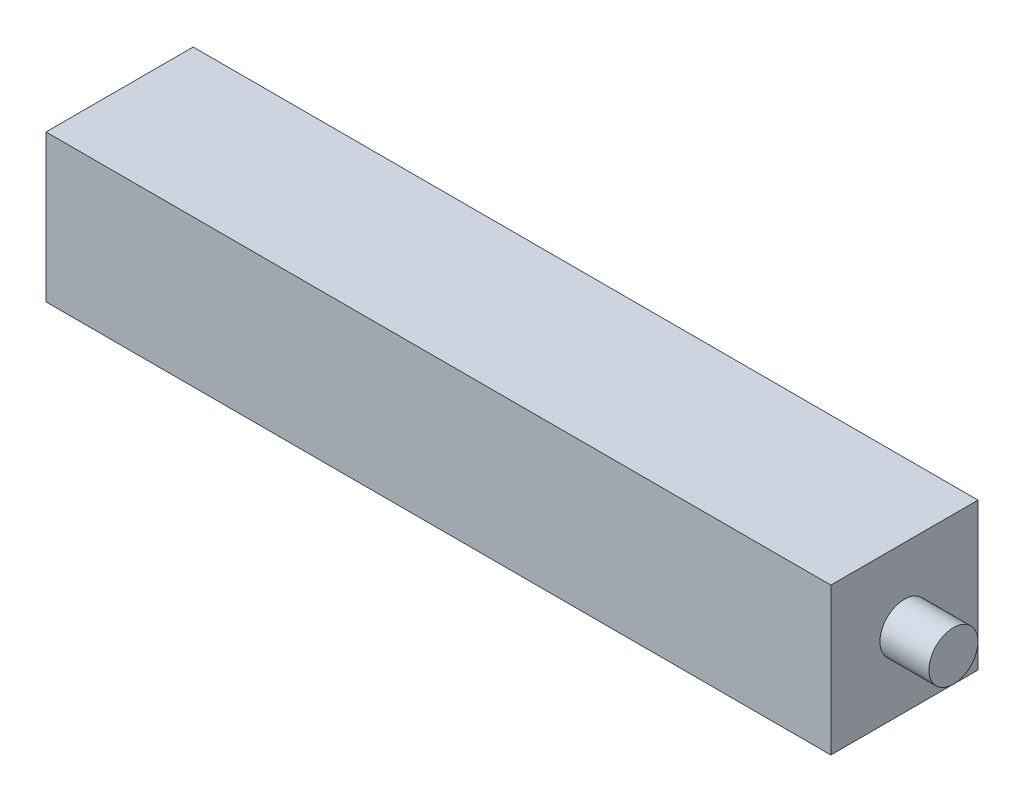
ISO-10303-21;
HEADER;
FILE_DESCRIPTION(('STEP AP214'),'2;1');
FILE_NAME('part.step','',(''),(''),'','','');
FILE_SCHEMA(('AUTOMOTIVE_DESIGN { 1 0 10303 214 1 1 1 1 }'));
ENDSEC;
DATA;
#1=APPLICATION_CONTEXT('core data for automotive mechanical design processes');
#2=APPLICATION_PROTOCOL_DEFINITION('international standard','automotive_design',2000,#1);
#3=PRODUCT_CONTEXT('',#1,'mechanical');
#4=PRODUCT('Part','Part','',(#3));
#5=PRODUCT_RELATED_PRODUCT_CATEGORY('part','',(#4));
#6=PRODUCT_DEFINITION_FORMATION('','',#4);
#7=PRODUCT_DEFINITION_CONTEXT('part definition',#1,'design');
#8=PRODUCT_DEFINITION('design','',#6,#7);
#9=PRODUCT_DEFINITION_SHAPE('','',#8);
#10=(LENGTH_UNIT() NAMED_UNIT(*) SI_UNIT(.MILLI.,.METRE.));
#11=(NAMED_UNIT(*) PLANE_ANGLE_UNIT() SI_UNIT($,.RADIAN.));
#12=(NAMED_UNIT(*) SI_UNIT($,.STERADIAN.) SOLID_ANGLE_UNIT());
#13=UNCERTAINTY_MEASURE_WITH_UNIT(LENGTH_MEASURE(1.E-05),#10,'distance_accuracy_value','');
#14=(GEOMETRIC_REPRESENTATION_CONTEXT(3) GLOBAL_UNCERTAINTY_ASSIGNED_CONTEXT((#13)) GLOBAL_UNIT_ASSIGNED_CONTEXT((#10,
#11,#12)) REPRESENTATION_CONTEXT('',''));
#15=CARTESIAN_POINT('',(0.,0.,0.));
#16=DIRECTION('',(0.,0.,1.));
#17=DIRECTION('',(1.,0.,0.));
#18=AXIS2_PLACEMENT_3D('',#15,#16,#17);
#19=CARTESIAN_POINT('',(101.6,38.1,-19.05));
#20=DIRECTION('',(-1.,0.,0.));
#21=DIRECTION('',(0.,0.,1.));
#22=AXIS2_PLACEMENT_3D('',#19,#20,#21);
#23=PLANE('',#22);
#24=CARTESIAN_POINT('',(101.6,19.05,0.));
#25=DIRECTION('',(1.,0.,0.));
#26=DIRECTION('',(0.,0.,-1.));
#27=AXIS2_PLACEMENT_3D('',#24,#25,#26);
#28=CIRCLE('',#27,6.35);
#29=CARTESIAN_POINT('',(101.6,19.05,-6.35000000000004));
#30=VERTEX_POINT('',#29);
#31=EDGE_CURVE('E43',#30,#30,#28,.T.);
#32=ORIENTED_EDGE('',*,*,#31,.F.);
#33=EDGE_LOOP('',(#32));
#34=FACE_BOUND('',#33,.T.);
#35=DIRECTION('',(0.,0.,-1.));
#36=VECTOR('',#35,1.);
#37=CARTESIAN_POINT('',(101.6,0.,-19.05));
#38=LINE('',#37,#36);
#39=CARTESIAN_POINT('',(101.6,0.,19.05));
#40=VERTEX_POINT('',#39);
#41=CARTESIAN_POINT('',(101.6,0.,-19.05));
#42=VERTEX_POINT('',#41);
#43=EDGE_CURVE('E101',#40,#42,#38,.T.);
#44=ORIENTED_EDGE('',*,*,#43,.T.);
#45=DIRECTION('',(0.,-1.,0.));
#46=VECTOR('',#45,1.);
#47=CARTESIAN_POINT('',(101.6,38.1,-19.05));
#48=LINE('',#47,#46);
#49=CARTESIAN_POINT('',(101.6,38.1,-19.05));
#50=VERTEX_POINT('',#49);
#51=EDGE_CURVE('E37',#50,#42,#48,.T.);
#52=ORIENTED_EDGE('',*,*,#51,.F.);
#53=DIRECTION('',(0.,0.,-1.));
#54=VECTOR('',#53,1.);
#55=CARTESIAN_POINT('',(101.6,38.1,-19.05));
#56=LINE('',#55,#54);
#57=CARTESIAN_POINT('',(101.6,38.1,19.05));
#58=VERTEX_POINT('',#57);
#59=EDGE_CURVE('E88',#58,#50,#56,.T.);
#60=ORIENTED_EDGE('',*,*,#59,.F.);
#61=DIRECTION('',(0.,-1.,0.));
#62=VECTOR('',#61,1.);
#63=CARTESIAN_POINT('',(101.6,38.1,19.05));
#64=LINE('',#63,#62);
#65=EDGE_CURVE('E97',#58,#40,#64,.T.);
#66=ORIENTED_EDGE('',*,*,#65,.T.);
#67=EDGE_LOOP('',(#44,#52,#60,#66));
#68=FACE_BOUND('',#67,.T.);
#69=ADVANCED_FACE('F34',(#34,#68),#23,.F.);
#70=CARTESIAN_POINT('',(-101.6,38.1,-19.05));
#71=DIRECTION('',(0.,0.,1.));
#72=DIRECTION('',(1.,0.,0.));
#73=AXIS2_PLACEMENT_3D('',#70,#71,#72);
#74=PLANE('',#73);
#75=DIRECTION('',(-1.,0.,0.));
#76=VECTOR('',#75,1.);
#77=CARTESIAN_POINT('',(-101.6,0.,-19.05));
#78=LINE('',#77,#76);
#79=CARTESIAN_POINT('',(-101.6,0.,-19.05));
#80=VERTEX_POINT('',#79);
#81=EDGE_CURVE('E93',#42,#80,#78,.T.);
#82=ORIENTED_EDGE('',*,*,#81,.T.);
#83=DIRECTION('',(0.,-1.,0.));
#84=VECTOR('',#83,1.);
#85=CARTESIAN_POINT('',(-101.6,38.1,-19.05));
#86=LINE('',#85,#84);
#87=CARTESIAN_POINT('',(-101.6,38.1,-19.05));
#88=VERTEX_POINT('',#87);
#89=EDGE_CURVE('E91',#88,#80,#86,.T.);
#90=ORIENTED_EDGE('',*,*,#89,.F.);
#91=DIRECTION('',(-1.,0.,0.));
#92=VECTOR('',#91,1.);
#93=CARTESIAN_POINT('',(-101.6,38.1,-19.05));
#94=LINE('',#93,#92);
#95=EDGE_CURVE('E83',#50,#88,#94,.T.);
#96=ORIENTED_EDGE('',*,*,#95,.F.);
#97=ORIENTED_EDGE('',*,*,#51,.T.);
#98=EDGE_LOOP('',(#82,#90,#96,#97));
#99=FACE_BOUND('',#98,.T.);
#100=ADVANCED_FACE('F92',(#99),#74,.F.);
#101=CARTESIAN_POINT('',(-101.6,38.1,-19.05));
#102=DIRECTION('',(1.,0.,0.));
#103=DIRECTION('',(0.,0.,-1.));
#104=AXIS2_PLACEMENT_3D('',#101,#102,#103);
#105=PLANE('',#104);
#106=CARTESIAN_POINT('',(-101.6,19.05,0.));
#107=DIRECTION('',(-1.,0.,0.));
#108=DIRECTION('',(0.,0.,1.));
#109=AXIS2_PLACEMENT_3D('',#106,#107,#108);
#110=CIRCLE('',#109,6.35);
#111=CARTESIAN_POINT('',(-101.6,19.05,6.35000000000004));
#112=VERTEX_POINT('',#111);
#113=EDGE_CURVE('E11',#112,#112,#110,.T.);
#114=ORIENTED_EDGE('',*,*,#113,.F.);
#115=EDGE_LOOP('',(#114));
#116=FACE_BOUND('',#115,.T.);
#117=DIRECTION('',(0.,0.,1.));
#118=VECTOR('',#117,1.);
#119=CARTESIAN_POINT('',(-101.6,0.,-19.05));
#120=LINE('',#119,#118);
#121=CARTESIAN_POINT('',(-101.6,0.,19.05));
#122=VERTEX_POINT('',#121);
#123=EDGE_CURVE('E69',#80,#122,#120,.T.);
#124=ORIENTED_EDGE('',*,*,#123,.T.);
#125=DIRECTION('',(0.,-1.,0.));
#126=VECTOR('',#125,1.);
#127=CARTESIAN_POINT('',(-101.6,38.1,19.05));
#128=LINE('',#127,#126);
#129=CARTESIAN_POINT('',(-101.6,38.1,19.05));
#130=VERTEX_POINT('',#129);
#131=EDGE_CURVE('E94',#130,#122,#128,.T.);
#132=ORIENTED_EDGE('',*,*,#131,.F.);
#133=DIRECTION('',(0.,0.,1.));
#134=VECTOR('',#133,1.);
#135=CARTESIAN_POINT('',(-101.6,38.1,-19.05));
#136=LINE('',#135,#134);
#137=EDGE_CURVE('E86',#88,#130,#136,.T.);
#138=ORIENTED_EDGE('',*,*,#137,.F.);
#139=ORIENTED_EDGE('',*,*,#89,.T.);
#140=EDGE_LOOP('',(#124,#132,#138,#139));
#141=FACE_BOUND('',#140,.T.);
#142=ADVANCED_FACE('F95',(#116,#141),#105,.F.);
#143=CARTESIAN_POINT('',(-101.6,38.1,19.05));
#144=DIRECTION('',(0.,0.,-1.));
#145=DIRECTION('',(-1.,0.,0.));
#146=AXIS2_PLACEMENT_3D('',#143,#144,#145);
#147=PLANE('',#146);
#148=DIRECTION('',(1.,0.,0.));
#149=VECTOR('',#148,1.);
#150=CARTESIAN_POINT('',(-101.6,0.,19.05));
#151=LINE('',#150,#149);
#152=EDGE_CURVE('E75',#122,#40,#151,.T.);
#153=ORIENTED_EDGE('',*,*,#152,.T.);
#154=ORIENTED_EDGE('',*,*,#65,.F.);
#155=DIRECTION('',(1.,0.,0.));
#156=VECTOR('',#155,1.);
#157=CARTESIAN_POINT('',(-101.6,38.1,19.05));
#158=LINE('',#157,#156);
#159=EDGE_CURVE('E52',#130,#58,#158,.T.);
#160=ORIENTED_EDGE('',*,*,#159,.F.);
#161=ORIENTED_EDGE('',*,*,#131,.T.);
#162=EDGE_LOOP('',(#153,#154,#160,#161));
#163=FACE_BOUND('',#162,.T.);
#164=ADVANCED_FACE('F109',(#163),#147,.F.);
#165=CARTESIAN_POINT('',(0.,38.1,0.));
#166=DIRECTION('',(0.,1.,0.));
#167=DIRECTION('',(0.,0.,1.));
#168=AXIS2_PLACEMENT_3D('',#165,#166,#167);
#169=PLANE('',#168);
#170=ORIENTED_EDGE('',*,*,#59,.T.);
#171=ORIENTED_EDGE('',*,*,#95,.T.);
#172=ORIENTED_EDGE('',*,*,#137,.T.);
#173=ORIENTED_EDGE('',*,*,#159,.T.);
#174=EDGE_LOOP('',(#170,#171,#172,#173));
#175=FACE_BOUND('',#174,.T.);
#176=ADVANCED_FACE('F84',(#175),#169,.T.);
#177=CARTESIAN_POINT('',(0.,0.,0.));
#178=DIRECTION('',(0.,1.,0.));
#179=DIRECTION('',(0.,0.,1.));
#180=AXIS2_PLACEMENT_3D('',#177,#178,#179);
#181=PLANE('',#180);
#182=ORIENTED_EDGE('',*,*,#43,.F.);
#183=ORIENTED_EDGE('',*,*,#152,.F.);
#184=ORIENTED_EDGE('',*,*,#123,.F.);
#185=ORIENTED_EDGE('',*,*,#81,.F.);
#186=EDGE_LOOP('',(#182,#183,#184,#185));
#187=FACE_BOUND('',#186,.T.);
#188=ADVANCED_FACE('F112',(#187),#181,.F.);
#189=CARTESIAN_POINT('',(114.3,19.05,0.));
#190=DIRECTION('',(-1.,0.,0.));
#191=DIRECTION('',(0.,0.,1.));
#192=AXIS2_PLACEMENT_3D('',#189,#190,#191);
#193=CYLINDRICAL_SURFACE('',#192,6.35);
#194=CARTESIAN_POINT('',(114.3,19.05,0.));
#195=DIRECTION('',(1.,0.,0.));
#196=DIRECTION('',(0.,0.,-1.));
#197=AXIS2_PLACEMENT_3D('',#194,#195,#196);
#198=CIRCLE('',#197,6.35);
#199=CARTESIAN_POINT('',(114.3,19.05,-6.35000000000005));
#200=VERTEX_POINT('',#199);
#201=EDGE_CURVE('E104',#200,#200,#198,.T.);
#202=ORIENTED_EDGE('',*,*,#201,.F.);
#203=EDGE_LOOP('',(#202));
#204=FACE_BOUND('',#203,.T.);
#205=ORIENTED_EDGE('',*,*,#31,.T.);
#206=EDGE_LOOP('',(#205));
#207=FACE_BOUND('',#206,.T.);
#208=ADVANCED_FACE('F145',(#204,#207),#193,.T.);
#209=CARTESIAN_POINT('',(114.3,19.05,0.));
#210=DIRECTION('',(1.,0.,0.));
#211=DIRECTION('',(0.,0.,-1.));
#212=AXIS2_PLACEMENT_3D('',#209,#210,#211);
#213=PLANE('',#212);
#214=ORIENTED_EDGE('',*,*,#201,.T.);
#215=EDGE_LOOP('',(#214));
#216=FACE_BOUND('',#215,.T.);
#217=ADVANCED_FACE('F128',(#216),#213,.T.);
#218=CARTESIAN_POINT('',(-114.3,19.05,0.));
#219=DIRECTION('',(1.,0.,0.));
#220=DIRECTION('',(0.,0.,-1.));
#221=AXIS2_PLACEMENT_3D('',#218,#219,#220);
#222=CYLINDRICAL_SURFACE('',#221,6.35);
#223=CARTESIAN_POINT('',(-114.3,19.05,0.));
#224=DIRECTION('',(-1.,0.,0.));
#225=DIRECTION('',(0.,0.,1.));
#226=AXIS2_PLACEMENT_3D('',#223,#224,#225);
#227=CIRCLE('',#226,6.35);
#228=CARTESIAN_POINT('',(-114.3,19.05,6.35000000000004));
#229=VERTEX_POINT('',#228);
#230=EDGE_CURVE('E118',#229,#229,#227,.T.);
#231=ORIENTED_EDGE('',*,*,#230,.F.);
#232=EDGE_LOOP('',(#231));
#233=FACE_BOUND('',#232,.T.);
#234=ORIENTED_EDGE('',*,*,#113,.T.);
#235=EDGE_LOOP('',(#234));
#236=FACE_BOUND('',#235,.T.);
#237=ADVANCED_FACE('F125',(#233,#236),#222,.T.);
#238=CARTESIAN_POINT('',(-114.3,19.05,0.));
#239=DIRECTION('',(-1.,0.,0.));
#240=DIRECTION('',(0.,0.,1.));
#241=AXIS2_PLACEMENT_3D('',#238,#239,#240);
#242=PLANE('',#241);
#243=ORIENTED_EDGE('',*,*,#230,.T.);
#244=EDGE_LOOP('',(#243));
#245=FACE_BOUND('',#244,.T.);
#246=ADVANCED_FACE('F123',(#245),#242,.T.);
#247=CLOSED_SHELL('',(#69,#100,#142,#164,#176,#188,#208,#217,#237,#246));
#248=MANIFOLD_SOLID_BREP('B2',#247);
#249=ADVANCED_BREP_SHAPE_REPRESENTATION('',(#18,#248),#14);
#250=SHAPE_DEFINITION_REPRESENTATION(#9,#249);
ENDSEC;
END-ISO-10303-21;
